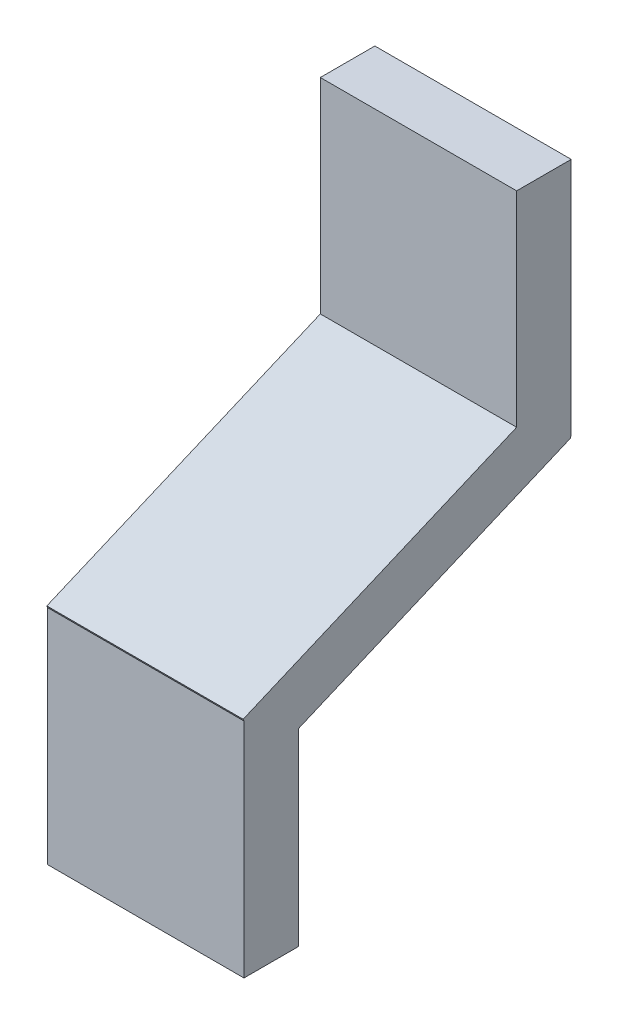
ISO-10303-21;
HEADER;
FILE_DESCRIPTION(('STEP AP214'),'2;1');
FILE_NAME('part.step','',(''),(''),'','','');
FILE_SCHEMA(('AUTOMOTIVE_DESIGN { 1 0 10303 214 1 1 1 1 }'));
ENDSEC;
DATA;
#1=APPLICATION_CONTEXT('core data for automotive mechanical design processes');
#2=APPLICATION_PROTOCOL_DEFINITION('international standard','automotive_design',2000,#1);
#3=PRODUCT_CONTEXT('',#1,'mechanical');
#4=PRODUCT('Part','Part','',(#3));
#5=PRODUCT_RELATED_PRODUCT_CATEGORY('part','',(#4));
#6=PRODUCT_DEFINITION_FORMATION('','',#4);
#7=PRODUCT_DEFINITION_CONTEXT('part definition',#1,'design');
#8=PRODUCT_DEFINITION('design','',#6,#7);
#9=PRODUCT_DEFINITION_SHAPE('','',#8);
#10=(LENGTH_UNIT() NAMED_UNIT(*) SI_UNIT(.MILLI.,.METRE.));
#11=(NAMED_UNIT(*) PLANE_ANGLE_UNIT() SI_UNIT($,.RADIAN.));
#12=(NAMED_UNIT(*) SI_UNIT($,.STERADIAN.) SOLID_ANGLE_UNIT());
#13=UNCERTAINTY_MEASURE_WITH_UNIT(LENGTH_MEASURE(1.E-05),#10,'distance_accuracy_value','');
#14=(GEOMETRIC_REPRESENTATION_CONTEXT(3) GLOBAL_UNCERTAINTY_ASSIGNED_CONTEXT((#13)) GLOBAL_UNIT_ASSIGNED_CONTEXT((#10,
#11,#12)) REPRESENTATION_CONTEXT('',''));
#15=CARTESIAN_POINT('',(0.,0.,0.));
#16=DIRECTION('',(0.,0.,1.));
#17=DIRECTION('',(1.,0.,0.));
#18=AXIS2_PLACEMENT_3D('',#15,#16,#17);
#19=CARTESIAN_POINT('',(9.02,11.,0.5));
#20=DIRECTION('',(0.,0.,1.));
#21=DIRECTION('',(1.,0.,0.));
#22=AXIS2_PLACEMENT_3D('',#19,#20,#21);
#23=PLANE('',#22);
#24=DIRECTION('',(1.,0.,0.));
#25=VECTOR('',#24,1.);
#26=CARTESIAN_POINT('',(9.02,11.3461054439247,0.500000000000314));
#27=LINE('',#26,#25);
#28=CARTESIAN_POINT('',(9.380000014305,11.3461054439242,0.500000000000105));
#29=VERTEX_POINT('',#28);
#30=CARTESIAN_POINT('',(9.02,11.3461054439243,0.500000000000105));
#31=VERTEX_POINT('',#30);
#32=EDGE_CURVE('E148',#29,#31,#27,.F.);
#33=ORIENTED_EDGE('',*,*,#32,.F.);
#34=DIRECTION('',(0.,1.,0.));
#35=VECTOR('',#34,1.);
#36=CARTESIAN_POINT('',(9.380000014305,11.65,0.5));
#37=LINE('',#36,#35);
#38=CARTESIAN_POINT('',(9.380000014305,11.,0.5));
#39=VERTEX_POINT('',#38);
#40=EDGE_CURVE('E154',#39,#29,#37,.T.);
#41=ORIENTED_EDGE('',*,*,#40,.F.);
#42=DIRECTION('',(1.,0.,0.));
#43=VECTOR('',#42,1.);
#44=CARTESIAN_POINT('',(9.02,11.,0.5));
#45=LINE('',#44,#43);
#46=CARTESIAN_POINT('',(9.02,11.,0.5));
#47=VERTEX_POINT('',#46);
#48=EDGE_CURVE('E135',#39,#47,#45,.F.);
#49=ORIENTED_EDGE('',*,*,#48,.T.);
#50=DIRECTION('',(0.,1.,0.));
#51=VECTOR('',#50,1.);
#52=CARTESIAN_POINT('',(9.02,11.65,0.5));
#53=LINE('',#52,#51);
#54=EDGE_CURVE('E182',#47,#31,#53,.T.);
#55=ORIENTED_EDGE('',*,*,#54,.T.);
#56=EDGE_LOOP('',(#33,#41,#49,#55));
#57=FACE_BOUND('',#56,.T.);
#58=ADVANCED_FACE('F17',(#57),#23,.F.);
#59=CARTESIAN_POINT('',(9.02,11.557949520001,0.0009268707435867));
#60=DIRECTION('',(0.,-0.920504786278108,-0.390731286742046));
#61=DIRECTION('',(0.,0.390731286742046,-0.920504786278108));
#62=AXIS2_PLACEMENT_3D('',#59,#60,#61);
#63=PLANE('',#62);
#64=DIRECTION('',(0.,0.39073128674346,-0.920504786277508));
#65=VECTOR('',#64,1.);
#66=CARTESIAN_POINT('',(9.380000014305,11.346105443924,0.5));
#67=LINE('',#66,#65);
#68=CARTESIAN_POINT('',(9.380000014305,11.557949520001,0.000926870743687995));
#69=VERTEX_POINT('',#68);
#70=EDGE_CURVE('E151',#29,#69,#67,.T.);
#71=ORIENTED_EDGE('',*,*,#70,.F.);
#72=ORIENTED_EDGE('',*,*,#32,.T.);
#73=DIRECTION('',(0.,0.39073128674346,-0.920504786277508));
#74=VECTOR('',#73,1.);
#75=CARTESIAN_POINT('',(9.02,11.346105443924,0.5));
#76=LINE('',#75,#74);
#77=CARTESIAN_POINT('',(9.02,11.557949520001,0.000926870743697318));
#78=VERTEX_POINT('',#77);
#79=EDGE_CURVE('E178',#31,#78,#76,.T.);
#80=ORIENTED_EDGE('',*,*,#79,.T.);
#81=DIRECTION('',(1.,0.,0.));
#82=VECTOR('',#81,1.);
#83=CARTESIAN_POINT('',(9.02,11.557949520001,0.000926870743744277));
#84=LINE('',#83,#82);
#85=EDGE_CURVE('E145',#78,#69,#84,.T.);
#86=ORIENTED_EDGE('',*,*,#85,.T.);
#87=EDGE_LOOP('',(#71,#72,#80,#86));
#88=FACE_BOUND('',#87,.T.);
#89=ADVANCED_FACE('F242',(#88),#63,.T.);
#90=CARTESIAN_POINT('',(9.02,11.65,0.04));
#91=DIRECTION('',(0.,-0.390731286742046,0.920504786278108));
#92=DIRECTION('',(0.,-0.920504786278108,-0.390731286742046));
#93=AXIS2_PLACEMENT_3D('',#90,#91,#92);
#94=PLANE('',#93);
#95=DIRECTION('',(0.,0.920504786259231,0.390731286786518));
#96=VECTOR('',#95,1.);
#97=CARTESIAN_POINT('',(9.02,11.557949520001,0.00092687074366));
#98=LINE('',#97,#96);
#99=CARTESIAN_POINT('',(9.02,11.56,0.001797248280528));
#100=VERTEX_POINT('',#99);
#101=EDGE_CURVE('E123',#78,#100,#98,.T.);
#102=ORIENTED_EDGE('',*,*,#101,.T.);
#103=DIRECTION('',(1.,0.,0.));
#104=VECTOR('',#103,1.);
#105=CARTESIAN_POINT('',(9.02,11.56,0.001797248280528));
#106=LINE('',#105,#104);
#107=CARTESIAN_POINT('',(9.380000014305,11.56,0.001797248280528));
#108=VERTEX_POINT('',#107);
#109=EDGE_CURVE('E97',#100,#108,#106,.T.);
#110=ORIENTED_EDGE('',*,*,#109,.T.);
#111=DIRECTION('',(0.,0.920504786259231,0.390731286786518));
#112=VECTOR('',#111,1.);
#113=CARTESIAN_POINT('',(9.380000014305,11.557949520001,0.00092687074366));
#114=LINE('',#113,#112);
#115=EDGE_CURVE('E153',#69,#108,#114,.T.);
#116=ORIENTED_EDGE('',*,*,#115,.F.);
#117=ORIENTED_EDGE('',*,*,#85,.F.);
#118=EDGE_LOOP('',(#102,#110,#116,#117));
#119=FACE_BOUND('',#118,.T.);
#120=ADVANCED_FACE('F243',(#119),#94,.F.);
#121=CARTESIAN_POINT('',(9.02,11.56,0.));
#122=DIRECTION('',(0.,1.,0.));
#123=DIRECTION('',(0.,0.,1.));
#124=AXIS2_PLACEMENT_3D('',#121,#122,#123);
#125=PLANE('',#124);
#126=ORIENTED_EDGE('',*,*,#109,.F.);
#127=DIRECTION('',(0.,0.,1.));
#128=VECTOR('',#127,1.);
#129=CARTESIAN_POINT('',(9.02,11.56,0.));
#130=LINE('',#129,#128);
#131=CARTESIAN_POINT('',(9.02,11.56,0.));
#132=VERTEX_POINT('',#131);
#133=EDGE_CURVE('E20',#100,#132,#130,.F.);
#134=ORIENTED_EDGE('',*,*,#133,.T.);
#135=DIRECTION('',(1.,0.,0.));
#136=VECTOR('',#135,1.);
#137=CARTESIAN_POINT('',(9.02,11.56,0.));
#138=LINE('',#137,#136);
#139=CARTESIAN_POINT('',(9.380000014305,11.56,0.));
#140=VERTEX_POINT('',#139);
#141=EDGE_CURVE('E104',#132,#140,#138,.T.);
#142=ORIENTED_EDGE('',*,*,#141,.T.);
#143=DIRECTION('',(0.,0.,-1.));
#144=VECTOR('',#143,1.);
#145=CARTESIAN_POINT('',(9.380000014305,11.56,0.04));
#146=LINE('',#145,#144);
#147=EDGE_CURVE('E194',#108,#140,#146,.T.);
#148=ORIENTED_EDGE('',*,*,#147,.F.);
#149=EDGE_LOOP('',(#126,#134,#142,#148));
#150=FACE_BOUND('',#149,.T.);
#151=ADVANCED_FACE('F122',(#150),#125,.F.);
#152=CARTESIAN_POINT('',(9.02,11.56,0.));
#153=DIRECTION('',(0.,0.,1.));
#154=DIRECTION('',(1.,0.,0.));
#155=AXIS2_PLACEMENT_3D('',#152,#153,#154);
#156=PLANE('',#155);
#157=ORIENTED_EDGE('',*,*,#141,.F.);
#158=DIRECTION('',(0.,1.,0.));
#159=VECTOR('',#158,1.);
#160=CARTESIAN_POINT('',(9.02,11.65,0.));
#161=LINE('',#160,#159);
#162=CARTESIAN_POINT('',(9.02,11.999999997616,0.));
#163=VERTEX_POINT('',#162);
#164=EDGE_CURVE('E108',#132,#163,#161,.T.);
#165=ORIENTED_EDGE('',*,*,#164,.T.);
#166=DIRECTION('',(1.,0.,0.));
#167=VECTOR('',#166,1.);
#168=CARTESIAN_POINT('',(9.02,11.999999997616,0.));
#169=LINE('',#168,#167);
#170=CARTESIAN_POINT('',(9.380000014305,11.999999997616,0.));
#171=VERTEX_POINT('',#170);
#172=EDGE_CURVE('E110',#171,#163,#169,.F.);
#173=ORIENTED_EDGE('',*,*,#172,.F.);
#174=DIRECTION('',(0.,1.,0.));
#175=VECTOR('',#174,1.);
#176=CARTESIAN_POINT('',(9.380000014305,11.65,0.));
#177=LINE('',#176,#175);
#178=EDGE_CURVE('E109',#140,#171,#177,.T.);
#179=ORIENTED_EDGE('',*,*,#178,.F.);
#180=EDGE_LOOP('',(#157,#165,#173,#179));
#181=FACE_BOUND('',#180,.T.);
#182=ADVANCED_FACE('F106',(#181),#156,.F.);
#183=CARTESIAN_POINT('',(9.02,11.999999997616,0.));
#184=DIRECTION('',(0.,1.,0.));
#185=DIRECTION('',(0.,0.,1.));
#186=AXIS2_PLACEMENT_3D('',#183,#184,#185);
#187=PLANE('',#186);
#188=ORIENTED_EDGE('',*,*,#172,.T.);
#189=DIRECTION('',(0.,0.,-1.));
#190=VECTOR('',#189,1.);
#191=CARTESIAN_POINT('',(9.02,11.999999997616,0.04));
#192=LINE('',#191,#190);
#193=CARTESIAN_POINT('',(9.02,11.999999997616,0.10000000149));
#194=VERTEX_POINT('',#193);
#195=EDGE_CURVE('E120',#163,#194,#192,.F.);
#196=ORIENTED_EDGE('',*,*,#195,.T.);
#197=DIRECTION('',(1.,0.,0.));
#198=VECTOR('',#197,1.);
#199=CARTESIAN_POINT('',(9.02,11.999999997616,0.10000000149));
#200=LINE('',#199,#198);
#201=CARTESIAN_POINT('',(9.380000014305,11.999999997616,0.10000000149));
#202=VERTEX_POINT('',#201);
#203=EDGE_CURVE('E181',#202,#194,#200,.F.);
#204=ORIENTED_EDGE('',*,*,#203,.F.);
#205=DIRECTION('',(0.,0.,-1.));
#206=VECTOR('',#205,1.);
#207=CARTESIAN_POINT('',(9.380000014305,11.999999997616,0.04));
#208=LINE('',#207,#206);
#209=EDGE_CURVE('E140',#171,#202,#208,.F.);
#210=ORIENTED_EDGE('',*,*,#209,.F.);
#211=EDGE_LOOP('',(#188,#196,#204,#210));
#212=FACE_BOUND('',#211,.T.);
#213=ADVANCED_FACE('F271',(#212),#187,.T.);
#214=CARTESIAN_POINT('',(9.02,11.,0.60000000149));
#215=DIRECTION('',(0.,0.,1.));
#216=DIRECTION('',(1.,0.,0.));
#217=AXIS2_PLACEMENT_3D('',#214,#215,#216);
#218=PLANE('',#217);
#219=DIRECTION('',(0.,1.,0.));
#220=VECTOR('',#219,1.);
#221=CARTESIAN_POINT('',(9.380000014305,11.65,0.60000000149));
#222=LINE('',#221,#220);
#223=CARTESIAN_POINT('',(9.380000014305,11.408101447657,0.600000001490072));
#224=VERTEX_POINT('',#223);
#225=CARTESIAN_POINT('',(9.380000014305,11.,0.60000000149));
#226=VERTEX_POINT('',#225);
#227=EDGE_CURVE('E168',#224,#226,#222,.F.);
#228=ORIENTED_EDGE('',*,*,#227,.F.);
#229=DIRECTION('',(1.,0.,0.));
#230=VECTOR('',#229,1.);
#231=CARTESIAN_POINT('',(9.02,11.4081014476569,0.600000001490144));
#232=LINE('',#231,#230);
#233=CARTESIAN_POINT('',(9.02,11.408101447657,0.600000001490072));
#234=VERTEX_POINT('',#233);
#235=EDGE_CURVE('E124',#234,#224,#232,.T.);
#236=ORIENTED_EDGE('',*,*,#235,.F.);
#237=DIRECTION('',(0.,1.,0.));
#238=VECTOR('',#237,1.);
#239=CARTESIAN_POINT('',(9.02,11.65,0.60000000149));
#240=LINE('',#239,#238);
#241=CARTESIAN_POINT('',(9.02,11.,0.60000000149));
#242=VERTEX_POINT('',#241);
#243=EDGE_CURVE('E192',#234,#242,#240,.F.);
#244=ORIENTED_EDGE('',*,*,#243,.T.);
#245=DIRECTION('',(1.,0.,0.));
#246=VECTOR('',#245,1.);
#247=CARTESIAN_POINT('',(9.02,11.,0.60000000149));
#248=LINE('',#247,#246);
#249=EDGE_CURVE('E127',#242,#226,#248,.T.);
#250=ORIENTED_EDGE('',*,*,#249,.T.);
#251=EDGE_LOOP('',(#228,#236,#244,#250));
#252=FACE_BOUND('',#251,.T.);
#253=ADVANCED_FACE('F232',(#252),#218,.T.);
#254=CARTESIAN_POINT('',(9.02,11.,0.5));
#255=DIRECTION('',(0.,1.,0.));
#256=DIRECTION('',(0.,0.,1.));
#257=AXIS2_PLACEMENT_3D('',#254,#255,#256);
#258=PLANE('',#257);
#259=DIRECTION('',(0.,0.,-1.));
#260=VECTOR('',#259,1.);
#261=CARTESIAN_POINT('',(9.02,11.,0.04));
#262=LINE('',#261,#260);
#263=EDGE_CURVE('E187',#242,#47,#262,.T.);
#264=ORIENTED_EDGE('',*,*,#263,.T.);
#265=ORIENTED_EDGE('',*,*,#48,.F.);
#266=DIRECTION('',(0.,0.,-1.));
#267=VECTOR('',#266,1.);
#268=CARTESIAN_POINT('',(9.380000014305,11.,0.04));
#269=LINE('',#268,#267);
#270=EDGE_CURVE('E164',#226,#39,#269,.T.);
#271=ORIENTED_EDGE('',*,*,#270,.F.);
#272=ORIENTED_EDGE('',*,*,#249,.F.);
#273=EDGE_LOOP('',(#264,#265,#271,#272));
#274=FACE_BOUND('',#273,.T.);
#275=ADVANCED_FACE('F235',(#274),#258,.F.);
#276=CARTESIAN_POINT('',(9.02,11.411653909498,0.601507932798));
#277=DIRECTION('',(0.,-0.390731286742046,0.920504786278108));
#278=DIRECTION('',(0.,-0.920504786278108,-0.390731286742046));
#279=AXIS2_PLACEMENT_3D('',#276,#277,#278);
#280=PLANE('',#279);
#281=ORIENTED_EDGE('',*,*,#235,.T.);
#282=DIRECTION('',(0.,-0.920504786262243,-0.390731286779422));
#283=VECTOR('',#282,1.);
#284=CARTESIAN_POINT('',(9.380000014305,11.411653909498,0.601507932798));
#285=LINE('',#284,#283);
#286=CARTESIAN_POINT('',(9.380000014305,11.4116539094979,0.601507932797974));
#287=VERTEX_POINT('',#286);
#288=EDGE_CURVE('E227',#287,#224,#285,.T.);
#289=ORIENTED_EDGE('',*,*,#288,.F.);
#290=DIRECTION('',(1.,0.,0.));
#291=VECTOR('',#290,1.);
#292=CARTESIAN_POINT('',(9.02,11.4116539094978,0.601507932797897));
#293=LINE('',#292,#291);
#294=CARTESIAN_POINT('',(9.02,11.4116539094979,0.601507932797974));
#295=VERTEX_POINT('',#294);
#296=EDGE_CURVE('E167',#287,#295,#293,.F.);
#297=ORIENTED_EDGE('',*,*,#296,.T.);
#298=DIRECTION('',(0.,-0.920504786262243,-0.390731286779422));
#299=VECTOR('',#298,1.);
#300=CARTESIAN_POINT('',(9.02,11.411653909498,0.601507932798));
#301=LINE('',#300,#299);
#302=EDGE_CURVE('E175',#295,#234,#301,.T.);
#303=ORIENTED_EDGE('',*,*,#302,.T.);
#304=EDGE_LOOP('',(#281,#289,#297,#303));
#305=FACE_BOUND('',#304,.T.);
#306=ADVANCED_FACE('F210',(#305),#280,.T.);
#307=CARTESIAN_POINT('',(9.02,11.65,0.04));
#308=DIRECTION('',(1.,0.,0.));
#309=DIRECTION('',(0.,0.,-1.));
#310=AXIS2_PLACEMENT_3D('',#307,#308,#309);
#311=PLANE('',#310);
#312=ORIENTED_EDGE('',*,*,#54,.F.);
#313=ORIENTED_EDGE('',*,*,#263,.F.);
#314=ORIENTED_EDGE('',*,*,#243,.F.);
#315=ORIENTED_EDGE('',*,*,#302,.F.);
#316=DIRECTION('',(0.,0.390731286742046,-0.920504786278108));
#317=VECTOR('',#316,1.);
#318=CARTESIAN_POINT('',(9.02,11.65,0.04));
#319=LINE('',#318,#317);
#320=CARTESIAN_POINT('',(9.02,11.624531498221,0.100000001490019));
#321=VERTEX_POINT('',#320);
#322=EDGE_CURVE('E216',#295,#321,#319,.T.);
#323=ORIENTED_EDGE('',*,*,#322,.T.);
#324=DIRECTION('',(0.,1.,0.));
#325=VECTOR('',#324,1.);
#326=CARTESIAN_POINT('',(9.02,11.56,0.10000000149));
#327=LINE('',#326,#325);
#328=EDGE_CURVE('E161',#194,#321,#327,.F.);
#329=ORIENTED_EDGE('',*,*,#328,.F.);
#330=ORIENTED_EDGE('',*,*,#195,.F.);
#331=ORIENTED_EDGE('',*,*,#164,.F.);
#332=ORIENTED_EDGE('',*,*,#133,.F.);
#333=ORIENTED_EDGE('',*,*,#101,.F.);
#334=ORIENTED_EDGE('',*,*,#79,.F.);
#335=EDGE_LOOP('',(#312,#313,#314,#315,#323,#329,#330,#331,#332,#333,#334));
#336=FACE_BOUND('',#335,.T.);
#337=ADVANCED_FACE('F115',(#336),#311,.F.);
#338=CARTESIAN_POINT('',(9.02,11.56,0.10000000149));
#339=DIRECTION('',(0.,0.,1.));
#340=DIRECTION('',(1.,0.,0.));
#341=AXIS2_PLACEMENT_3D('',#338,#339,#340);
#342=PLANE('',#341);
#343=ORIENTED_EDGE('',*,*,#328,.T.);
#344=DIRECTION('',(1.,0.,0.));
#345=VECTOR('',#344,1.);
#346=CARTESIAN_POINT('',(9.02,11.6245314982212,0.100000001490075));
#347=LINE('',#346,#345);
#348=CARTESIAN_POINT('',(9.380000014305,11.624531498221,0.100000001490019));
#349=VERTEX_POINT('',#348);
#350=EDGE_CURVE('E26',#321,#349,#347,.T.);
#351=ORIENTED_EDGE('',*,*,#350,.T.);
#352=DIRECTION('',(0.,1.,0.));
#353=VECTOR('',#352,1.);
#354=CARTESIAN_POINT('',(9.380000014305,11.65,0.10000000149));
#355=LINE('',#354,#353);
#356=EDGE_CURVE('E34',#202,#349,#355,.F.);
#357=ORIENTED_EDGE('',*,*,#356,.F.);
#358=ORIENTED_EDGE('',*,*,#203,.T.);
#359=EDGE_LOOP('',(#343,#351,#357,#358));
#360=FACE_BOUND('',#359,.T.);
#361=ADVANCED_FACE('F257',(#360),#342,.T.);
#362=CARTESIAN_POINT('',(9.380000014305,11.65,0.04));
#363=DIRECTION('',(1.,0.,0.));
#364=DIRECTION('',(0.,0.,-1.));
#365=AXIS2_PLACEMENT_3D('',#362,#363,#364);
#366=PLANE('',#365);
#367=ORIENTED_EDGE('',*,*,#227,.T.);
#368=ORIENTED_EDGE('',*,*,#270,.T.);
#369=ORIENTED_EDGE('',*,*,#40,.T.);
#370=ORIENTED_EDGE('',*,*,#70,.T.);
#371=ORIENTED_EDGE('',*,*,#115,.T.);
#372=ORIENTED_EDGE('',*,*,#147,.T.);
#373=ORIENTED_EDGE('',*,*,#178,.T.);
#374=ORIENTED_EDGE('',*,*,#209,.T.);
#375=ORIENTED_EDGE('',*,*,#356,.T.);
#376=DIRECTION('',(0.,0.390731286742046,-0.920504786278108));
#377=VECTOR('',#376,1.);
#378=CARTESIAN_POINT('',(9.380000014305,11.65,0.04));
#379=LINE('',#378,#377);
#380=EDGE_CURVE('E11',#349,#287,#379,.F.);
#381=ORIENTED_EDGE('',*,*,#380,.T.);
#382=ORIENTED_EDGE('',*,*,#288,.T.);
#383=EDGE_LOOP('',(#367,#368,#369,#370,#371,#372,#373,#374,#375,#381,#382));
#384=FACE_BOUND('',#383,.T.);
#385=ADVANCED_FACE('F230',(#384),#366,.T.);
#386=CARTESIAN_POINT('',(9.02,11.65,0.04));
#387=DIRECTION('',(0.,-0.920504786278108,-0.390731286742046));
#388=DIRECTION('',(0.,0.390731286742046,-0.920504786278108));
#389=AXIS2_PLACEMENT_3D('',#386,#387,#388);
#390=PLANE('',#389);
#391=ORIENTED_EDGE('',*,*,#350,.F.);
#392=ORIENTED_EDGE('',*,*,#322,.F.);
#393=ORIENTED_EDGE('',*,*,#296,.F.);
#394=ORIENTED_EDGE('',*,*,#380,.F.);
#395=EDGE_LOOP('',(#391,#392,#393,#394));
#396=FACE_BOUND('',#395,.T.);
#397=ADVANCED_FACE('F220',(#396),#390,.F.);
#398=CLOSED_SHELL('',(#58,#89,#120,#151,#182,#213,#253,#275,#306,#337,#361,#385,#397));
#399=MANIFOLD_SOLID_BREP('B1',#398);
#400=ADVANCED_BREP_SHAPE_REPRESENTATION('',(#18,#399),#14);
#401=SHAPE_DEFINITION_REPRESENTATION(#9,#400);
ENDSEC;
END-ISO-10303-21;
